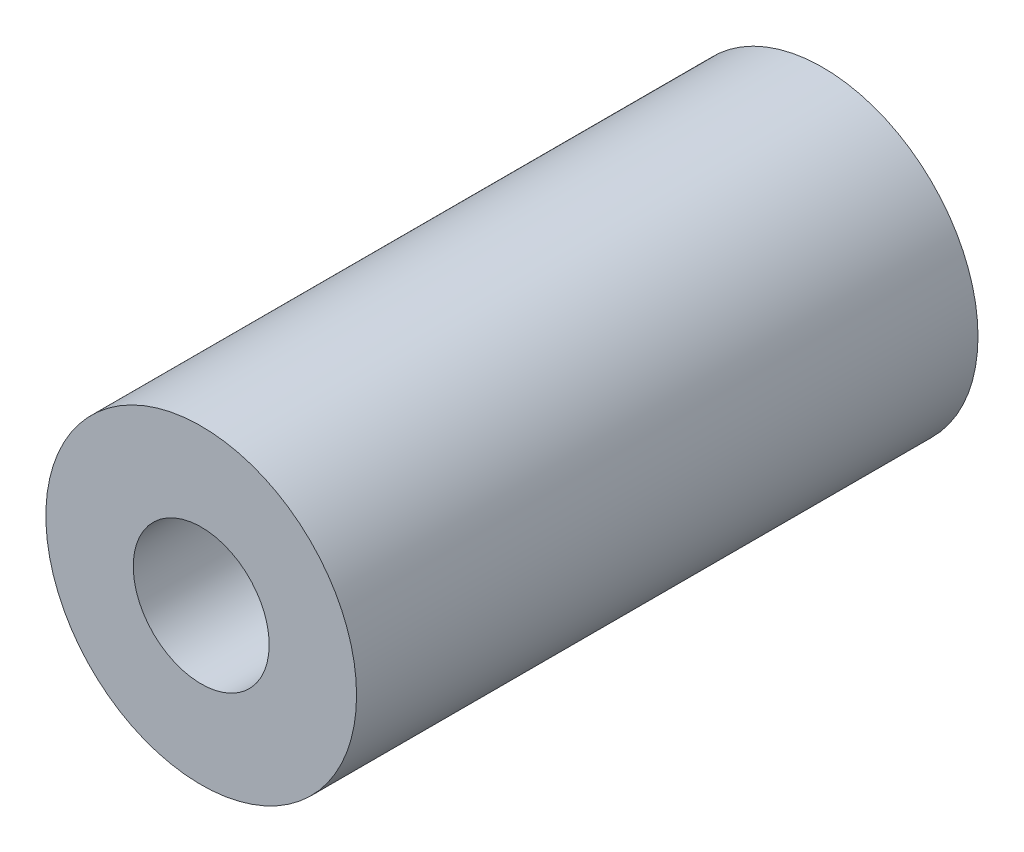
ISO-10303-21;
HEADER;
FILE_DESCRIPTION(('STEP AP214'),'2;1');
FILE_NAME('part.step','',(''),(''),'','','');
FILE_SCHEMA(('AUTOMOTIVE_DESIGN { 1 0 10303 214 1 1 1 1 }'));
ENDSEC;
DATA;
#1=APPLICATION_CONTEXT('core data for automotive mechanical design processes');
#2=APPLICATION_PROTOCOL_DEFINITION('international standard','automotive_design',2000,#1);
#3=PRODUCT_CONTEXT('',#1,'mechanical');
#4=PRODUCT('Part','Part','',(#3));
#5=PRODUCT_RELATED_PRODUCT_CATEGORY('part','',(#4));
#6=PRODUCT_DEFINITION_FORMATION('','',#4);
#7=PRODUCT_DEFINITION_CONTEXT('part definition',#1,'design');
#8=PRODUCT_DEFINITION('design','',#6,#7);
#9=PRODUCT_DEFINITION_SHAPE('','',#8);
#10=(LENGTH_UNIT() NAMED_UNIT(*) SI_UNIT(.MILLI.,.METRE.));
#11=(NAMED_UNIT(*) PLANE_ANGLE_UNIT() SI_UNIT($,.RADIAN.));
#12=(NAMED_UNIT(*) SI_UNIT($,.STERADIAN.) SOLID_ANGLE_UNIT());
#13=UNCERTAINTY_MEASURE_WITH_UNIT(LENGTH_MEASURE(1.E-05),#10,'distance_accuracy_value','');
#14=(GEOMETRIC_REPRESENTATION_CONTEXT(3) GLOBAL_UNCERTAINTY_ASSIGNED_CONTEXT((#13)) GLOBAL_UNIT_ASSIGNED_CONTEXT((#10,
#11,#12)) REPRESENTATION_CONTEXT('',''));
#15=CARTESIAN_POINT('',(0.,0.,0.));
#16=DIRECTION('',(0.,0.,1.));
#17=DIRECTION('',(1.,0.,0.));
#18=AXIS2_PLACEMENT_3D('',#15,#16,#17);
#19=CARTESIAN_POINT('',(50.1294434949154,0.,55.6));
#20=DIRECTION('',(0.,0.,1.));
#21=DIRECTION('',(1.,0.,0.));
#22=AXIS2_PLACEMENT_3D('',#19,#20,#21);
#23=PLANE('',#22);
#24=CARTESIAN_POINT('',(50.1294434949154,-15.5776526520014,55.6));
#25=DIRECTION('',(0.,0.,-1.));
#26=DIRECTION('',(1.,0.,0.));
#27=AXIS2_PLACEMENT_3D('',#24,#25,#26);
#28=CIRCLE('',#27,4.);
#29=CARTESIAN_POINT('',(54.1294434949154,-15.5776526520014,55.6));
#30=VERTEX_POINT('',#29);
#31=EDGE_CURVE('E11',#30,#30,#28,.T.);
#32=ORIENTED_EDGE('',*,*,#31,.T.);
#33=EDGE_LOOP('',(#32));
#34=FACE_BOUND('',#33,.T.);
#35=CARTESIAN_POINT('',(50.1294434949154,-15.5776526520014,55.6));
#36=DIRECTION('',(0.,0.,1.));
#37=DIRECTION('',(1.,0.,0.));
#38=AXIS2_PLACEMENT_3D('',#35,#36,#37);
#39=CIRCLE('',#38,1.75);
#40=CARTESIAN_POINT('',(51.8794434949154,-15.5776526520014,55.6));
#41=VERTEX_POINT('',#40);
#42=EDGE_CURVE('E54',#41,#41,#39,.T.);
#43=ORIENTED_EDGE('',*,*,#42,.T.);
#44=EDGE_LOOP('',(#43));
#45=FACE_BOUND('',#44,.T.);
#46=ADVANCED_FACE('F17',(#34,#45),#23,.F.);
#47=CARTESIAN_POINT('',(50.1294434949154,0.,71.6));
#48=DIRECTION('',(0.,0.,1.));
#49=DIRECTION('',(1.,0.,0.));
#50=AXIS2_PLACEMENT_3D('',#47,#48,#49);
#51=PLANE('',#50);
#52=CARTESIAN_POINT('',(50.1294434949154,-15.5776526520014,71.6));
#53=DIRECTION('',(0.,0.,-1.));
#54=DIRECTION('',(1.,0.,0.));
#55=AXIS2_PLACEMENT_3D('',#52,#53,#54);
#56=CIRCLE('',#55,4.);
#57=CARTESIAN_POINT('',(54.1294434949154,-15.5776526520014,71.6));
#58=VERTEX_POINT('',#57);
#59=EDGE_CURVE('E27',#58,#58,#56,.T.);
#60=ORIENTED_EDGE('',*,*,#59,.F.);
#61=EDGE_LOOP('',(#60));
#62=FACE_BOUND('',#61,.T.);
#63=CARTESIAN_POINT('',(50.1294434949154,-15.5776526520014,71.6));
#64=DIRECTION('',(0.,0.,1.));
#65=DIRECTION('',(1.,0.,0.));
#66=AXIS2_PLACEMENT_3D('',#63,#64,#65);
#67=CIRCLE('',#66,1.75);
#68=CARTESIAN_POINT('',(51.8794434949154,-15.5776526520014,71.6));
#69=VERTEX_POINT('',#68);
#70=EDGE_CURVE('E21',#69,#69,#67,.T.);
#71=ORIENTED_EDGE('',*,*,#70,.F.);
#72=EDGE_LOOP('',(#71));
#73=FACE_BOUND('',#72,.T.);
#74=ADVANCED_FACE('F74',(#62,#73),#51,.T.);
#75=CARTESIAN_POINT('',(50.1294434949154,-15.5776526520014,71.6));
#76=DIRECTION('',(0.,0.,-1.));
#77=DIRECTION('',(-1.,0.,0.));
#78=AXIS2_PLACEMENT_3D('',#75,#76,#77);
#79=CYLINDRICAL_SURFACE('',#78,4.);
#80=ORIENTED_EDGE('',*,*,#31,.F.);
#81=EDGE_LOOP('',(#80));
#82=FACE_BOUND('',#81,.T.);
#83=ORIENTED_EDGE('',*,*,#59,.T.);
#84=EDGE_LOOP('',(#83));
#85=FACE_BOUND('',#84,.T.);
#86=ADVANCED_FACE('F69',(#82,#85),#79,.T.);
#87=CARTESIAN_POINT('',(50.1294434949154,-15.5776526520014,71.6));
#88=DIRECTION('',(0.,0.,-1.));
#89=DIRECTION('',(-1.,0.,0.));
#90=AXIS2_PLACEMENT_3D('',#87,#88,#89);
#91=CYLINDRICAL_SURFACE('',#90,1.75);
#92=ORIENTED_EDGE('',*,*,#42,.F.);
#93=EDGE_LOOP('',(#92));
#94=FACE_BOUND('',#93,.T.);
#95=ORIENTED_EDGE('',*,*,#70,.T.);
#96=EDGE_LOOP('',(#95));
#97=FACE_BOUND('',#96,.T.);
#98=ADVANCED_FACE('F19',(#94,#97),#91,.F.);
#99=CLOSED_SHELL('',(#46,#74,#86,#98));
#100=MANIFOLD_SOLID_BREP('B1',#99);
#101=ADVANCED_BREP_SHAPE_REPRESENTATION('',(#18,#100),#14);
#102=SHAPE_DEFINITION_REPRESENTATION(#9,#101);
ENDSEC;
END-ISO-10303-21;
